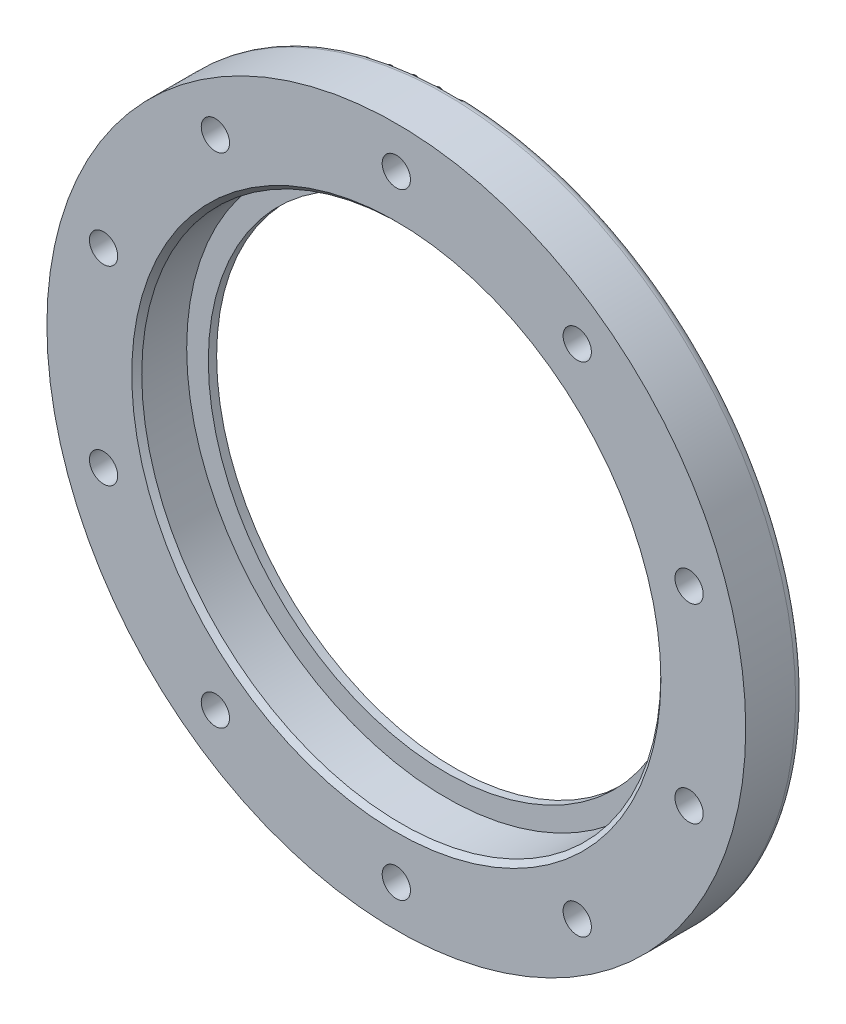
ISO-10303-21;
HEADER;
FILE_DESCRIPTION(('STEP AP214'),'2;1');
FILE_NAME('part.step','',(''),(''),'','','');
FILE_SCHEMA(('AUTOMOTIVE_DESIGN { 1 0 10303 214 1 1 1 1 }'));
ENDSEC;
DATA;
#1=APPLICATION_CONTEXT('core data for automotive mechanical design processes');
#2=APPLICATION_PROTOCOL_DEFINITION('international standard','automotive_design',2000,#1);
#3=PRODUCT_CONTEXT('',#1,'mechanical');
#4=PRODUCT('Part','Part','',(#3));
#5=PRODUCT_RELATED_PRODUCT_CATEGORY('part','',(#4));
#6=PRODUCT_DEFINITION_FORMATION('','',#4);
#7=PRODUCT_DEFINITION_CONTEXT('part definition',#1,'design');
#8=PRODUCT_DEFINITION('design','',#6,#7);
#9=PRODUCT_DEFINITION_SHAPE('','',#8);
#10=(LENGTH_UNIT() NAMED_UNIT(*) SI_UNIT(.MILLI.,.METRE.));
#11=(NAMED_UNIT(*) PLANE_ANGLE_UNIT() SI_UNIT($,.RADIAN.));
#12=(NAMED_UNIT(*) SI_UNIT($,.STERADIAN.) SOLID_ANGLE_UNIT());
#13=UNCERTAINTY_MEASURE_WITH_UNIT(LENGTH_MEASURE(1.E-05),#10,'distance_accuracy_value','');
#14=(GEOMETRIC_REPRESENTATION_CONTEXT(3) GLOBAL_UNCERTAINTY_ASSIGNED_CONTEXT((#13)) GLOBAL_UNIT_ASSIGNED_CONTEXT((#10,
#11,#12)) REPRESENTATION_CONTEXT('',''));
#15=CARTESIAN_POINT('',(0.,0.,0.));
#16=DIRECTION('',(0.,0.,1.));
#17=DIRECTION('',(1.,0.,0.));
#18=AXIS2_PLACEMENT_3D('',#15,#16,#17);
#19=CARTESIAN_POINT('',(21.7480543348212,29.9336287918721,6.));
#20=DIRECTION('',(0.,0.,-1.));
#21=DIRECTION('',(-1.,0.,0.));
#22=AXIS2_PLACEMENT_3D('',#19,#20,#21);
#23=CYLINDRICAL_SURFACE('',#22,1.70000000000102);
#24=CARTESIAN_POINT('',(21.7480543348212,29.9336287918721,6.));
#25=DIRECTION('',(0.,0.,-1.));
#26=DIRECTION('',(-1.,0.,0.));
#27=AXIS2_PLACEMENT_3D('',#24,#25,#26);
#28=CIRCLE('',#27,1.70000000000102);
#29=CARTESIAN_POINT('',(20.0480543348202,29.9336287918721,6.));
#30=VERTEX_POINT('',#29);
#31=EDGE_CURVE('E83',#30,#30,#28,.T.);
#32=ORIENTED_EDGE('',*,*,#31,.F.);
#33=EDGE_LOOP('',(#32));
#34=FACE_BOUND('',#33,.T.);
#35=CARTESIAN_POINT('',(21.7480543348212,29.9336287918721,2.2));
#36=DIRECTION('',(0.,0.,-1.));
#37=DIRECTION('',(-1.,0.,0.));
#38=AXIS2_PLACEMENT_3D('',#35,#36,#37);
#39=CIRCLE('',#38,1.70000000000102);
#40=CARTESIAN_POINT('',(20.0480543348202,29.9336287918721,2.2));
#41=VERTEX_POINT('',#40);
#42=EDGE_CURVE('E51',#41,#41,#39,.F.);
#43=ORIENTED_EDGE('',*,*,#42,.F.);
#44=EDGE_LOOP('',(#43));
#45=FACE_BOUND('',#44,.T.);
#46=ADVANCED_FACE('F30',(#34,#45),#23,.F.);
#47=CARTESIAN_POINT('',(35.1890911029196,11.4336287918716,6.));
#48=DIRECTION('',(0.,0.,-1.));
#49=DIRECTION('',(-1.,0.,0.));
#50=AXIS2_PLACEMENT_3D('',#47,#48,#49);
#51=CYLINDRICAL_SURFACE('',#50,1.70000000000188);
#52=CARTESIAN_POINT('',(35.1890911029196,11.4336287918716,6.));
#53=DIRECTION('',(0.,0.,-1.));
#54=DIRECTION('',(-1.,0.,0.));
#55=AXIS2_PLACEMENT_3D('',#52,#53,#54);
#56=CIRCLE('',#55,1.70000000000188);
#57=CARTESIAN_POINT('',(33.4890911029177,11.4336287918716,6.));
#58=VERTEX_POINT('',#57);
#59=EDGE_CURVE('E102',#58,#58,#56,.T.);
#60=ORIENTED_EDGE('',*,*,#59,.F.);
#61=EDGE_LOOP('',(#60));
#62=FACE_BOUND('',#61,.T.);
#63=CARTESIAN_POINT('',(35.1890911029196,11.4336287918716,2.2));
#64=DIRECTION('',(0.,0.,-1.));
#65=DIRECTION('',(-1.,0.,0.));
#66=AXIS2_PLACEMENT_3D('',#63,#64,#65);
#67=CIRCLE('',#66,1.70000000000188);
#68=CARTESIAN_POINT('',(33.4890911029177,11.4336287918716,2.2));
#69=VERTEX_POINT('',#68);
#70=EDGE_CURVE('E55',#69,#69,#67,.F.);
#71=ORIENTED_EDGE('',*,*,#70,.F.);
#72=EDGE_LOOP('',(#71));
#73=FACE_BOUND('',#72,.T.);
#74=ADVANCED_FACE('F242',(#62,#73),#51,.F.);
#75=CARTESIAN_POINT('',(35.1890911029186,-11.4336287918746,6.));
#76=DIRECTION('',(0.,0.,-1.));
#77=DIRECTION('',(-1.,0.,0.));
#78=AXIS2_PLACEMENT_3D('',#75,#76,#77);
#79=CYLINDRICAL_SURFACE('',#78,1.70000000000275);
#80=CARTESIAN_POINT('',(35.1890911029186,-11.4336287918746,6.));
#81=DIRECTION('',(0.,0.,-1.));
#82=DIRECTION('',(-1.,0.,0.));
#83=AXIS2_PLACEMENT_3D('',#80,#81,#82);
#84=CIRCLE('',#83,1.70000000000275);
#85=CARTESIAN_POINT('',(33.4890911029159,-11.4336287918746,6.));
#86=VERTEX_POINT('',#85);
#87=EDGE_CURVE('E105',#86,#86,#84,.T.);
#88=ORIENTED_EDGE('',*,*,#87,.F.);
#89=EDGE_LOOP('',(#88));
#90=FACE_BOUND('',#89,.T.);
#91=CARTESIAN_POINT('',(35.1890911029186,-11.4336287918746,2.2));
#92=DIRECTION('',(0.,0.,-1.));
#93=DIRECTION('',(-1.,0.,0.));
#94=AXIS2_PLACEMENT_3D('',#91,#92,#93);
#95=CIRCLE('',#94,1.70000000000275);
#96=CARTESIAN_POINT('',(33.4890911029159,-11.4336287918746,2.2));
#97=VERTEX_POINT('',#96);
#98=EDGE_CURVE('E58',#97,#97,#95,.F.);
#99=ORIENTED_EDGE('',*,*,#98,.F.);
#100=EDGE_LOOP('',(#99));
#101=FACE_BOUND('',#100,.T.);
#102=ADVANCED_FACE('F248',(#90,#101),#79,.F.);
#103=CARTESIAN_POINT('',(21.7480543348187,-29.933628791874,6.));
#104=DIRECTION('',(0.,0.,-1.));
#105=DIRECTION('',(-1.,0.,0.));
#106=AXIS2_PLACEMENT_3D('',#103,#104,#105);
#107=CYLINDRICAL_SURFACE('',#106,1.7000000000033);
#108=CARTESIAN_POINT('',(21.7480543348187,-29.933628791874,6.));
#109=DIRECTION('',(0.,0.,-1.));
#110=DIRECTION('',(-1.,0.,0.));
#111=AXIS2_PLACEMENT_3D('',#108,#109,#110);
#112=CIRCLE('',#111,1.7000000000033);
#113=CARTESIAN_POINT('',(20.0480543348154,-29.933628791874,6.));
#114=VERTEX_POINT('',#113);
#115=EDGE_CURVE('E108',#114,#114,#112,.T.);
#116=ORIENTED_EDGE('',*,*,#115,.F.);
#117=EDGE_LOOP('',(#116));
#118=FACE_BOUND('',#117,.T.);
#119=CARTESIAN_POINT('',(21.7480543348187,-29.933628791874,2.2));
#120=DIRECTION('',(0.,0.,-1.));
#121=DIRECTION('',(-1.,0.,0.));
#122=AXIS2_PLACEMENT_3D('',#119,#120,#121);
#123=CIRCLE('',#122,1.7000000000033);
#124=CARTESIAN_POINT('',(20.0480543348154,-29.933628791874,2.2));
#125=VERTEX_POINT('',#124);
#126=EDGE_CURVE('E61',#125,#125,#123,.F.);
#127=ORIENTED_EDGE('',*,*,#126,.F.);
#128=EDGE_LOOP('',(#127));
#129=FACE_BOUND('',#128,.T.);
#130=ADVANCED_FACE('F298',(#118,#129),#107,.F.);
#131=CARTESIAN_POINT('',(-3.14574736046115E-12,-37.,6.));
#132=DIRECTION('',(0.,0.,-1.));
#133=DIRECTION('',(-1.,0.,0.));
#134=AXIS2_PLACEMENT_3D('',#131,#132,#133);
#135=CYLINDRICAL_SURFACE('',#134,1.70000000000325);
#136=CARTESIAN_POINT('',(-3.14574736046115E-12,-37.,6.));
#137=DIRECTION('',(0.,0.,-1.));
#138=DIRECTION('',(-1.,0.,0.));
#139=AXIS2_PLACEMENT_3D('',#136,#137,#138);
#140=CIRCLE('',#139,1.70000000000325);
#141=CARTESIAN_POINT('',(-1.7000000000064,-37.,6.));
#142=VERTEX_POINT('',#141);
#143=EDGE_CURVE('E111',#142,#142,#140,.T.);
#144=ORIENTED_EDGE('',*,*,#143,.F.);
#145=EDGE_LOOP('',(#144));
#146=FACE_BOUND('',#145,.T.);
#147=CARTESIAN_POINT('',(-3.14574736046115E-12,-37.,2.2));
#148=DIRECTION('',(0.,0.,-1.));
#149=DIRECTION('',(-1.,0.,0.));
#150=AXIS2_PLACEMENT_3D('',#147,#148,#149);
#151=CIRCLE('',#150,1.70000000000325);
#152=CARTESIAN_POINT('',(-1.7000000000064,-37.,2.2));
#153=VERTEX_POINT('',#152);
#154=EDGE_CURVE('E64',#153,#153,#151,.F.);
#155=ORIENTED_EDGE('',*,*,#154,.F.);
#156=EDGE_LOOP('',(#155));
#157=FACE_BOUND('',#156,.T.);
#158=ADVANCED_FACE('F294',(#146,#157),#135,.F.);
#159=CARTESIAN_POINT('',(-21.7480543348244,-29.9336287918721,6.));
#160=DIRECTION('',(0.,0.,-1.));
#161=DIRECTION('',(-1.,0.,0.));
#162=AXIS2_PLACEMENT_3D('',#159,#160,#161);
#163=CYLINDRICAL_SURFACE('',#162,1.70000000000265);
#164=CARTESIAN_POINT('',(-21.7480543348244,-29.9336287918721,6.));
#165=DIRECTION('',(0.,0.,-1.));
#166=DIRECTION('',(-1.,0.,0.));
#167=AXIS2_PLACEMENT_3D('',#164,#165,#166);
#168=CIRCLE('',#167,1.70000000000265);
#169=CARTESIAN_POINT('',(-23.448054334827,-29.9336287918721,6.));
#170=VERTEX_POINT('',#169);
#171=EDGE_CURVE('E114',#170,#170,#168,.T.);
#172=ORIENTED_EDGE('',*,*,#171,.F.);
#173=EDGE_LOOP('',(#172));
#174=FACE_BOUND('',#173,.T.);
#175=CARTESIAN_POINT('',(-21.7480543348244,-29.9336287918721,2.2));
#176=DIRECTION('',(0.,0.,-1.));
#177=DIRECTION('',(-1.,0.,0.));
#178=AXIS2_PLACEMENT_3D('',#175,#176,#177);
#179=CIRCLE('',#178,1.70000000000265);
#180=CARTESIAN_POINT('',(-23.448054334827,-29.9336287918721,2.2));
#181=VERTEX_POINT('',#180);
#182=EDGE_CURVE('E67',#181,#181,#179,.F.);
#183=ORIENTED_EDGE('',*,*,#182,.F.);
#184=EDGE_LOOP('',(#183));
#185=FACE_BOUND('',#184,.T.);
#186=ADVANCED_FACE('F290',(#174,#185),#163,.F.);
#187=CARTESIAN_POINT('',(-35.1890911029227,-11.4336287918716,6.));
#188=DIRECTION('',(0.,0.,-1.));
#189=DIRECTION('',(-1.,0.,0.));
#190=AXIS2_PLACEMENT_3D('',#187,#188,#189);
#191=CYLINDRICAL_SURFACE('',#190,1.70000000000169);
#192=CARTESIAN_POINT('',(-35.1890911029227,-11.4336287918716,6.));
#193=DIRECTION('',(0.,0.,-1.));
#194=DIRECTION('',(-1.,0.,0.));
#195=AXIS2_PLACEMENT_3D('',#192,#193,#194);
#196=CIRCLE('',#195,1.70000000000169);
#197=CARTESIAN_POINT('',(-36.8890911029244,-11.4336287918716,6.));
#198=VERTEX_POINT('',#197);
#199=EDGE_CURVE('E117',#198,#198,#196,.T.);
#200=ORIENTED_EDGE('',*,*,#199,.F.);
#201=EDGE_LOOP('',(#200));
#202=FACE_BOUND('',#201,.T.);
#203=CARTESIAN_POINT('',(-35.1890911029227,-11.4336287918716,2.2));
#204=DIRECTION('',(0.,0.,-1.));
#205=DIRECTION('',(-1.,0.,0.));
#206=AXIS2_PLACEMENT_3D('',#203,#204,#205);
#207=CIRCLE('',#206,1.70000000000169);
#208=CARTESIAN_POINT('',(-36.8890911029244,-11.4336287918716,2.2));
#209=VERTEX_POINT('',#208);
#210=EDGE_CURVE('E70',#209,#209,#207,.F.);
#211=ORIENTED_EDGE('',*,*,#210,.F.);
#212=EDGE_LOOP('',(#211));
#213=FACE_BOUND('',#212,.T.);
#214=ADVANCED_FACE('F286',(#202,#213),#191,.F.);
#215=CARTESIAN_POINT('',(-35.1890911029218,11.4336287918746,6.));
#216=DIRECTION('',(0.,0.,-1.));
#217=DIRECTION('',(-1.,0.,0.));
#218=AXIS2_PLACEMENT_3D('',#215,#216,#217);
#219=CYLINDRICAL_SURFACE('',#218,1.70000000000071);
#220=CARTESIAN_POINT('',(-35.1890911029218,11.4336287918746,6.));
#221=DIRECTION('',(0.,0.,-1.));
#222=DIRECTION('',(-1.,0.,0.));
#223=AXIS2_PLACEMENT_3D('',#220,#221,#222);
#224=CIRCLE('',#223,1.70000000000071);
#225=CARTESIAN_POINT('',(-36.8890911029225,11.4336287918746,6.));
#226=VERTEX_POINT('',#225);
#227=EDGE_CURVE('E120',#226,#226,#224,.T.);
#228=ORIENTED_EDGE('',*,*,#227,.F.);
#229=EDGE_LOOP('',(#228));
#230=FACE_BOUND('',#229,.T.);
#231=CARTESIAN_POINT('',(-35.1890911029218,11.4336287918746,2.2));
#232=DIRECTION('',(0.,0.,-1.));
#233=DIRECTION('',(-1.,0.,0.));
#234=AXIS2_PLACEMENT_3D('',#231,#232,#233);
#235=CIRCLE('',#234,1.70000000000071);
#236=CARTESIAN_POINT('',(-36.8890911029225,11.4336287918746,2.2));
#237=VERTEX_POINT('',#236);
#238=EDGE_CURVE('E73',#237,#237,#235,.F.);
#239=ORIENTED_EDGE('',*,*,#238,.F.);
#240=EDGE_LOOP('',(#239));
#241=FACE_BOUND('',#240,.T.);
#242=ADVANCED_FACE('F264',(#230,#241),#219,.F.);
#243=CARTESIAN_POINT('',(-21.7480543348218,29.933628791874,6.));
#244=DIRECTION('',(0.,0.,-1.));
#245=DIRECTION('',(-1.,0.,0.));
#246=AXIS2_PLACEMENT_3D('',#243,#244,#245);
#247=CYLINDRICAL_SURFACE('',#246,1.70000000000007);
#248=CARTESIAN_POINT('',(-21.7480543348218,29.933628791874,6.));
#249=DIRECTION('',(0.,0.,-1.));
#250=DIRECTION('',(-1.,0.,0.));
#251=AXIS2_PLACEMENT_3D('',#248,#249,#250);
#252=CIRCLE('',#251,1.70000000000007);
#253=CARTESIAN_POINT('',(-23.4480543348219,29.933628791874,6.));
#254=VERTEX_POINT('',#253);
#255=EDGE_CURVE('E99',#254,#254,#252,.T.);
#256=ORIENTED_EDGE('',*,*,#255,.F.);
#257=EDGE_LOOP('',(#256));
#258=FACE_BOUND('',#257,.T.);
#259=CARTESIAN_POINT('',(-21.7480543348218,29.933628791874,2.2));
#260=DIRECTION('',(0.,0.,-1.));
#261=DIRECTION('',(-1.,0.,0.));
#262=AXIS2_PLACEMENT_3D('',#259,#260,#261);
#263=CIRCLE('',#262,1.70000000000007);
#264=CARTESIAN_POINT('',(-23.4480543348219,29.933628791874,2.2));
#265=VERTEX_POINT('',#264);
#266=EDGE_CURVE('E76',#265,#265,#263,.F.);
#267=ORIENTED_EDGE('',*,*,#266,.F.);
#268=EDGE_LOOP('',(#267));
#269=FACE_BOUND('',#268,.T.);
#270=ADVANCED_FACE('F257',(#258,#269),#247,.F.);
#271=CARTESIAN_POINT('',(0.,37.,6.));
#272=DIRECTION('',(0.,0.,-1.));
#273=DIRECTION('',(-1.,0.,0.));
#274=AXIS2_PLACEMENT_3D('',#271,#272,#273);
#275=CYLINDRICAL_SURFACE('',#274,1.7);
#276=CARTESIAN_POINT('',(0.,37.,6.));
#277=DIRECTION('',(0.,0.,-1.));
#278=DIRECTION('',(-1.,0.,0.));
#279=AXIS2_PLACEMENT_3D('',#276,#277,#278);
#280=CIRCLE('',#279,1.7);
#281=CARTESIAN_POINT('',(-1.7,37.,6.));
#282=VERTEX_POINT('',#281);
#283=EDGE_CURVE('E94',#282,#282,#280,.T.);
#284=ORIENTED_EDGE('',*,*,#283,.F.);
#285=EDGE_LOOP('',(#284));
#286=FACE_BOUND('',#285,.T.);
#287=CARTESIAN_POINT('',(0.,37.,2.2));
#288=DIRECTION('',(0.,0.,-1.));
#289=DIRECTION('',(-1.,0.,0.));
#290=AXIS2_PLACEMENT_3D('',#287,#288,#289);
#291=CIRCLE('',#290,1.7);
#292=CARTESIAN_POINT('',(-1.7,37.,2.2));
#293=VERTEX_POINT('',#292);
#294=EDGE_CURVE('E80',#293,#293,#291,.F.);
#295=ORIENTED_EDGE('',*,*,#294,.F.);
#296=EDGE_LOOP('',(#295));
#297=FACE_BOUND('',#296,.T.);
#298=ADVANCED_FACE('F255',(#286,#297),#275,.F.);
#299=CARTESIAN_POINT('',(0.,0.,6.));
#300=DIRECTION('',(0.,0.,1.));
#301=DIRECTION('',(1.,0.,0.));
#302=AXIS2_PLACEMENT_3D('',#299,#300,#301);
#303=PLANE('',#302);
#304=CARTESIAN_POINT('',(0.,0.,6.));
#305=DIRECTION('',(0.,0.,1.));
#306=DIRECTION('',(1.,0.,0.));
#307=AXIS2_PLACEMENT_3D('',#304,#305,#306);
#308=CIRCLE('',#307,31.8);
#309=CARTESIAN_POINT('',(31.8,0.,6.));
#310=VERTEX_POINT('',#309);
#311=EDGE_CURVE('E41',#310,#310,#308,.F.);
#312=ORIENTED_EDGE('',*,*,#311,.T.);
#313=EDGE_LOOP('',(#312));
#314=FACE_BOUND('',#313,.T.);
#315=ORIENTED_EDGE('',*,*,#255,.T.);
#316=EDGE_LOOP('',(#315));
#317=FACE_BOUND('',#316,.T.);
#318=ORIENTED_EDGE('',*,*,#227,.T.);
#319=EDGE_LOOP('',(#318));
#320=FACE_BOUND('',#319,.T.);
#321=ORIENTED_EDGE('',*,*,#199,.T.);
#322=EDGE_LOOP('',(#321));
#323=FACE_BOUND('',#322,.T.);
#324=ORIENTED_EDGE('',*,*,#171,.T.);
#325=EDGE_LOOP('',(#324));
#326=FACE_BOUND('',#325,.T.);
#327=ORIENTED_EDGE('',*,*,#143,.T.);
#328=EDGE_LOOP('',(#327));
#329=FACE_BOUND('',#328,.T.);
#330=ORIENTED_EDGE('',*,*,#115,.T.);
#331=EDGE_LOOP('',(#330));
#332=FACE_BOUND('',#331,.T.);
#333=ORIENTED_EDGE('',*,*,#87,.T.);
#334=EDGE_LOOP('',(#333));
#335=FACE_BOUND('',#334,.T.);
#336=ORIENTED_EDGE('',*,*,#59,.T.);
#337=EDGE_LOOP('',(#336));
#338=FACE_BOUND('',#337,.T.);
#339=ORIENTED_EDGE('',*,*,#31,.T.);
#340=EDGE_LOOP('',(#339));
#341=FACE_BOUND('',#340,.T.);
#342=ORIENTED_EDGE('',*,*,#283,.T.);
#343=EDGE_LOOP('',(#342));
#344=FACE_BOUND('',#343,.T.);
#345=CARTESIAN_POINT('',(0.,0.,6.));
#346=DIRECTION('',(0.,0.,1.));
#347=DIRECTION('',(1.,0.,0.));
#348=AXIS2_PLACEMENT_3D('',#345,#346,#347);
#349=CIRCLE('',#348,42.);
#350=CARTESIAN_POINT('',(42.,0.,6.));
#351=VERTEX_POINT('',#350);
#352=EDGE_CURVE('E50',#351,#351,#349,.T.);
#353=ORIENTED_EDGE('',*,*,#352,.T.);
#354=EDGE_LOOP('',(#353));
#355=FACE_BOUND('',#354,.T.);
#356=ADVANCED_FACE('F238',(#314,#317,#320,#323,#326,#329,#332,#335,#338,#341,#344,#355),#303,.T.);
#357=CARTESIAN_POINT('',(0.,0.,6.));
#358=DIRECTION('',(0.,0.,-1.));
#359=DIRECTION('',(-1.,0.,0.));
#360=AXIS2_PLACEMENT_3D('',#357,#358,#359);
#361=CYLINDRICAL_SURFACE('',#360,42.);
#362=CARTESIAN_POINT('',(0.,0.,0.));
#363=DIRECTION('',(0.,0.,-1.));
#364=DIRECTION('',(-1.,0.,0.));
#365=AXIS2_PLACEMENT_3D('',#362,#363,#364);
#366=CIRCLE('',#365,42.);
#367=CARTESIAN_POINT('',(-42.,0.,0.));
#368=VERTEX_POINT('',#367);
#369=EDGE_CURVE('E10',#368,#368,#366,.F.);
#370=ORIENTED_EDGE('',*,*,#369,.T.);
#371=EDGE_LOOP('',(#370));
#372=FACE_BOUND('',#371,.T.);
#373=ORIENTED_EDGE('',*,*,#352,.F.);
#374=EDGE_LOOP('',(#373));
#375=FACE_BOUND('',#374,.T.);
#376=ADVANCED_FACE('F232',(#372,#375),#361,.T.);
#377=CARTESIAN_POINT('',(0.,0.,6.));
#378=DIRECTION('',(0.,0.,-1.));
#379=DIRECTION('',(-1.,0.,0.));
#380=AXIS2_PLACEMENT_3D('',#377,#378,#379);
#381=CYLINDRICAL_SURFACE('',#380,31.2);
#382=CARTESIAN_POINT('',(0.,0.,5.40000000000003));
#383=DIRECTION('',(0.,0.,1.));
#384=DIRECTION('',(1.,0.,0.));
#385=AXIS2_PLACEMENT_3D('',#382,#383,#384);
#386=CIRCLE('',#385,31.2);
#387=CARTESIAN_POINT('',(31.2,0.,5.40000000000003));
#388=VERTEX_POINT('',#387);
#389=EDGE_CURVE('E45',#388,#388,#386,.T.);
#390=ORIENTED_EDGE('',*,*,#389,.T.);
#391=EDGE_LOOP('',(#390));
#392=FACE_BOUND('',#391,.T.);
#393=CARTESIAN_POINT('',(0.,0.,0.));
#394=DIRECTION('',(0.,0.,1.));
#395=DIRECTION('',(1.,0.,0.));
#396=AXIS2_PLACEMENT_3D('',#393,#394,#395);
#397=CIRCLE('',#396,31.2);
#398=CARTESIAN_POINT('',(31.2,0.,0.));
#399=VERTEX_POINT('',#398);
#400=EDGE_CURVE('E87',#399,#399,#397,.T.);
#401=ORIENTED_EDGE('',*,*,#400,.F.);
#402=EDGE_LOOP('',(#401));
#403=FACE_BOUND('',#402,.T.);
#404=ADVANCED_FACE('F227',(#392,#403),#381,.F.);
#405=CARTESIAN_POINT('',(0.,0.,0.));
#406=DIRECTION('',(0.,0.,-1.));
#407=DIRECTION('',(-1.,0.,0.));
#408=AXIS2_PLACEMENT_3D('',#405,#406,#407);
#409=PLANE('',#408);
#410=CARTESIAN_POINT('',(0.,0.,0.));
#411=DIRECTION('',(0.,0.,-1.));
#412=DIRECTION('',(-1.,0.,0.));
#413=AXIS2_PLACEMENT_3D('',#410,#411,#412);
#414=CIRCLE('',#413,28.6);
#415=CARTESIAN_POINT('',(-28.6,0.,0.));
#416=VERTEX_POINT('',#415);
#417=EDGE_CURVE('E91',#416,#416,#414,.T.);
#418=ORIENTED_EDGE('',*,*,#417,.T.);
#419=EDGE_LOOP('',(#418));
#420=FACE_BOUND('',#419,.T.);
#421=ORIENTED_EDGE('',*,*,#400,.T.);
#422=EDGE_LOOP('',(#421));
#423=FACE_BOUND('',#422,.T.);
#424=ADVANCED_FACE('F197',(#420,#423),#409,.F.);
#425=CARTESIAN_POINT('',(0.,0.,-1.));
#426=DIRECTION('',(0.,0.,-1.));
#427=DIRECTION('',(-1.,0.,0.));
#428=AXIS2_PLACEMENT_3D('',#425,#426,#427);
#429=PLANE('',#428);
#430=CARTESIAN_POINT('',(0.,0.,-1.));
#431=DIRECTION('',(0.,0.,-1.));
#432=DIRECTION('',(-1.,0.,0.));
#433=AXIS2_PLACEMENT_3D('',#430,#431,#432);
#434=CIRCLE('',#433,41.);
#435=CARTESIAN_POINT('',(-41.,0.,-1.));
#436=VERTEX_POINT('',#435);
#437=EDGE_CURVE('E37',#436,#436,#434,.T.);
#438=ORIENTED_EDGE('',*,*,#437,.T.);
#439=EDGE_LOOP('',(#438));
#440=FACE_BOUND('',#439,.T.);
#441=CARTESIAN_POINT('',(-21.7480543348218,29.933628791874,-1.));
#442=DIRECTION('',(0.,0.,-1.));
#443=DIRECTION('',(-1.,0.,0.));
#444=AXIS2_PLACEMENT_3D('',#441,#442,#443);
#445=CIRCLE('',#444,3.00000000000007);
#446=CARTESIAN_POINT('',(-24.7480543348219,29.933628791874,-1.));
#447=VERTEX_POINT('',#446);
#448=EDGE_CURVE('E177',#447,#447,#445,.T.);
#449=ORIENTED_EDGE('',*,*,#448,.F.);
#450=EDGE_LOOP('',(#449));
#451=FACE_BOUND('',#450,.T.);
#452=CARTESIAN_POINT('',(-35.1890911029218,11.4336287918746,-1.));
#453=DIRECTION('',(0.,0.,-1.));
#454=DIRECTION('',(-1.,0.,0.));
#455=AXIS2_PLACEMENT_3D('',#452,#453,#454);
#456=CIRCLE('',#455,3.00000000000071);
#457=CARTESIAN_POINT('',(-38.1890911029225,11.4336287918746,-1.));
#458=VERTEX_POINT('',#457);
#459=EDGE_CURVE('E171',#458,#458,#456,.T.);
#460=ORIENTED_EDGE('',*,*,#459,.F.);
#461=EDGE_LOOP('',(#460));
#462=FACE_BOUND('',#461,.T.);
#463=CARTESIAN_POINT('',(-35.1890911029227,-11.4336287918716,-1.));
#464=DIRECTION('',(0.,0.,-1.));
#465=DIRECTION('',(-1.,0.,0.));
#466=AXIS2_PLACEMENT_3D('',#463,#464,#465);
#467=CIRCLE('',#466,3.00000000000169);
#468=CARTESIAN_POINT('',(-38.1890911029244,-11.4336287918716,-1.));
#469=VERTEX_POINT('',#468);
#470=EDGE_CURVE('E165',#469,#469,#467,.T.);
#471=ORIENTED_EDGE('',*,*,#470,.F.);
#472=EDGE_LOOP('',(#471));
#473=FACE_BOUND('',#472,.T.);
#474=CARTESIAN_POINT('',(-21.7480543348244,-29.9336287918721,-1.));
#475=DIRECTION('',(0.,0.,-1.));
#476=DIRECTION('',(-1.,0.,0.));
#477=AXIS2_PLACEMENT_3D('',#474,#475,#476);
#478=CIRCLE('',#477,3.00000000000265);
#479=CARTESIAN_POINT('',(-24.748054334827,-29.9336287918721,-1.));
#480=VERTEX_POINT('',#479);
#481=EDGE_CURVE('E159',#480,#480,#478,.T.);
#482=ORIENTED_EDGE('',*,*,#481,.F.);
#483=EDGE_LOOP('',(#482));
#484=FACE_BOUND('',#483,.T.);
#485=CARTESIAN_POINT('',(-3.14574736046115E-12,-37.,-1.));
#486=DIRECTION('',(0.,0.,-1.));
#487=DIRECTION('',(-1.,0.,0.));
#488=AXIS2_PLACEMENT_3D('',#485,#486,#487);
#489=CIRCLE('',#488,3.00000000000326);
#490=CARTESIAN_POINT('',(-3.0000000000064,-37.,-1.));
#491=VERTEX_POINT('',#490);
#492=EDGE_CURVE('E153',#491,#491,#489,.T.);
#493=ORIENTED_EDGE('',*,*,#492,.F.);
#494=EDGE_LOOP('',(#493));
#495=FACE_BOUND('',#494,.T.);
#496=CARTESIAN_POINT('',(21.7480543348187,-29.933628791874,-1.));
#497=DIRECTION('',(0.,0.,-1.));
#498=DIRECTION('',(-1.,0.,0.));
#499=AXIS2_PLACEMENT_3D('',#496,#497,#498);
#500=CIRCLE('',#499,3.0000000000033);
#501=CARTESIAN_POINT('',(18.7480543348154,-29.933628791874,-1.));
#502=VERTEX_POINT('',#501);
#503=EDGE_CURVE('E147',#502,#502,#500,.T.);
#504=ORIENTED_EDGE('',*,*,#503,.F.);
#505=EDGE_LOOP('',(#504));
#506=FACE_BOUND('',#505,.T.);
#507=CARTESIAN_POINT('',(35.1890911029186,-11.4336287918746,-1.));
#508=DIRECTION('',(0.,0.,-1.));
#509=DIRECTION('',(-1.,0.,0.));
#510=AXIS2_PLACEMENT_3D('',#507,#508,#509);
#511=CIRCLE('',#510,3.00000000000275);
#512=CARTESIAN_POINT('',(32.1890911029159,-11.4336287918746,-1.));
#513=VERTEX_POINT('',#512);
#514=EDGE_CURVE('E141',#513,#513,#511,.T.);
#515=ORIENTED_EDGE('',*,*,#514,.F.);
#516=EDGE_LOOP('',(#515));
#517=FACE_BOUND('',#516,.T.);
#518=CARTESIAN_POINT('',(35.1890911029196,11.4336287918716,-1.));
#519=DIRECTION('',(0.,0.,-1.));
#520=DIRECTION('',(-1.,0.,0.));
#521=AXIS2_PLACEMENT_3D('',#518,#519,#520);
#522=CIRCLE('',#521,3.00000000000188);
#523=CARTESIAN_POINT('',(32.1890911029177,11.4336287918716,-1.));
#524=VERTEX_POINT('',#523);
#525=EDGE_CURVE('E135',#524,#524,#522,.T.);
#526=ORIENTED_EDGE('',*,*,#525,.F.);
#527=EDGE_LOOP('',(#526));
#528=FACE_BOUND('',#527,.T.);
#529=CARTESIAN_POINT('',(21.7480543348212,29.9336287918721,-1.));
#530=DIRECTION('',(0.,0.,-1.));
#531=DIRECTION('',(-1.,0.,0.));
#532=AXIS2_PLACEMENT_3D('',#529,#530,#531);
#533=CIRCLE('',#532,3.00000000000103);
#534=CARTESIAN_POINT('',(18.7480543348202,29.9336287918721,-1.));
#535=VERTEX_POINT('',#534);
#536=EDGE_CURVE('E129',#535,#535,#533,.T.);
#537=ORIENTED_EDGE('',*,*,#536,.F.);
#538=EDGE_LOOP('',(#537));
#539=FACE_BOUND('',#538,.T.);
#540=CARTESIAN_POINT('',(0.,37.,-1.));
#541=DIRECTION('',(0.,0.,-1.));
#542=DIRECTION('',(-1.,0.,0.));
#543=AXIS2_PLACEMENT_3D('',#540,#541,#542);
#544=CIRCLE('',#543,3.);
#545=CARTESIAN_POINT('',(-3.,37.,-1.));
#546=VERTEX_POINT('',#545);
#547=EDGE_CURVE('E54',#546,#546,#544,.T.);
#548=ORIENTED_EDGE('',*,*,#547,.F.);
#549=EDGE_LOOP('',(#548));
#550=FACE_BOUND('',#549,.T.);
#551=CARTESIAN_POINT('',(0.,0.,-1.));
#552=DIRECTION('',(0.,0.,-1.));
#553=DIRECTION('',(-1.,0.,0.));
#554=AXIS2_PLACEMENT_3D('',#551,#552,#553);
#555=CIRCLE('',#554,28.6);
#556=CARTESIAN_POINT('',(-28.6,0.,-1.));
#557=VERTEX_POINT('',#556);
#558=EDGE_CURVE('E90',#557,#557,#555,.T.);
#559=ORIENTED_EDGE('',*,*,#558,.F.);
#560=EDGE_LOOP('',(#559));
#561=FACE_BOUND('',#560,.T.);
#562=ADVANCED_FACE('F193',(#440,#451,#462,#473,#484,#495,#506,#517,#528,#539,#550,#561),#429,.T.);
#563=CARTESIAN_POINT('',(0.,0.,-1.));
#564=DIRECTION('',(0.,0.,1.));
#565=DIRECTION('',(1.,0.,0.));
#566=AXIS2_PLACEMENT_3D('',#563,#564,#565);
#567=CYLINDRICAL_SURFACE('',#566,28.6);
#568=ORIENTED_EDGE('',*,*,#558,.T.);
#569=EDGE_LOOP('',(#568));
#570=FACE_BOUND('',#569,.T.);
#571=ORIENTED_EDGE('',*,*,#417,.F.);
#572=EDGE_LOOP('',(#571));
#573=FACE_BOUND('',#572,.T.);
#574=ADVANCED_FACE('F196',(#570,#573),#567,.F.);
#575=CARTESIAN_POINT('',(0.,37.,2.2));
#576=DIRECTION('',(0.,0.,-1.));
#577=DIRECTION('',(-1.,0.,0.));
#578=AXIS2_PLACEMENT_3D('',#575,#576,#577);
#579=PLANE('',#578);
#580=CARTESIAN_POINT('',(0.,37.,2.2));
#581=DIRECTION('',(0.,0.,-1.));
#582=DIRECTION('',(-1.,0.,0.));
#583=AXIS2_PLACEMENT_3D('',#580,#581,#582);
#584=CIRCLE('',#583,3.);
#585=CARTESIAN_POINT('',(-3.,37.,2.2));
#586=VERTEX_POINT('',#585);
#587=EDGE_CURVE('E84',#586,#586,#584,.T.);
#588=ORIENTED_EDGE('',*,*,#587,.T.);
#589=EDGE_LOOP('',(#588));
#590=FACE_BOUND('',#589,.T.);
#591=ORIENTED_EDGE('',*,*,#294,.T.);
#592=EDGE_LOOP('',(#591));
#593=FACE_BOUND('',#592,.T.);
#594=ADVANCED_FACE('F221',(#590,#593),#579,.T.);
#595=CARTESIAN_POINT('',(0.,37.,2.2));
#596=DIRECTION('',(0.,0.,-1.));
#597=DIRECTION('',(-1.,0.,0.));
#598=AXIS2_PLACEMENT_3D('',#595,#596,#597);
#599=CYLINDRICAL_SURFACE('',#598,3.);
#600=ORIENTED_EDGE('',*,*,#587,.F.);
#601=EDGE_LOOP('',(#600));
#602=FACE_BOUND('',#601,.T.);
#603=ORIENTED_EDGE('',*,*,#547,.T.);
#604=EDGE_LOOP('',(#603));
#605=FACE_BOUND('',#604,.T.);
#606=ADVANCED_FACE('F272',(#602,#605),#599,.F.);
#607=CARTESIAN_POINT('',(-21.7480543348218,29.933628791874,2.2));
#608=DIRECTION('',(0.,0.,-1.));
#609=DIRECTION('',(-1.,0.,0.));
#610=AXIS2_PLACEMENT_3D('',#607,#608,#609);
#611=PLANE('',#610);
#612=CARTESIAN_POINT('',(-21.7480543348218,29.933628791874,2.2));
#613=DIRECTION('',(0.,0.,-1.));
#614=DIRECTION('',(-1.,0.,0.));
#615=AXIS2_PLACEMENT_3D('',#612,#613,#614);
#616=CIRCLE('',#615,3.00000000000007);
#617=CARTESIAN_POINT('',(-24.7480543348219,29.933628791874,2.2));
#618=VERTEX_POINT('',#617);
#619=EDGE_CURVE('E79',#618,#618,#616,.T.);
#620=ORIENTED_EDGE('',*,*,#619,.T.);
#621=EDGE_LOOP('',(#620));
#622=FACE_BOUND('',#621,.T.);
#623=ORIENTED_EDGE('',*,*,#266,.T.);
#624=EDGE_LOOP('',(#623));
#625=FACE_BOUND('',#624,.T.);
#626=ADVANCED_FACE('F183',(#622,#625),#611,.T.);
#627=CARTESIAN_POINT('',(-21.7480543348218,29.933628791874,2.2));
#628=DIRECTION('',(0.,0.,-1.));
#629=DIRECTION('',(-1.,0.,0.));
#630=AXIS2_PLACEMENT_3D('',#627,#628,#629);
#631=CYLINDRICAL_SURFACE('',#630,3.00000000000007);
#632=ORIENTED_EDGE('',*,*,#619,.F.);
#633=EDGE_LOOP('',(#632));
#634=FACE_BOUND('',#633,.T.);
#635=ORIENTED_EDGE('',*,*,#448,.T.);
#636=EDGE_LOOP('',(#635));
#637=FACE_BOUND('',#636,.T.);
#638=ADVANCED_FACE('F186',(#634,#637),#631,.F.);
#639=CARTESIAN_POINT('',(-35.1890911029218,11.4336287918746,2.2));
#640=DIRECTION('',(0.,0.,-1.));
#641=DIRECTION('',(-1.,0.,0.));
#642=AXIS2_PLACEMENT_3D('',#639,#640,#641);
#643=PLANE('',#642);
#644=CARTESIAN_POINT('',(-35.1890911029218,11.4336287918746,2.2));
#645=DIRECTION('',(0.,0.,-1.));
#646=DIRECTION('',(-1.,0.,0.));
#647=AXIS2_PLACEMENT_3D('',#644,#645,#646);
#648=CIRCLE('',#647,3.00000000000071);
#649=CARTESIAN_POINT('',(-38.1890911029225,11.4336287918746,2.2));
#650=VERTEX_POINT('',#649);
#651=EDGE_CURVE('E174',#650,#650,#648,.T.);
#652=ORIENTED_EDGE('',*,*,#651,.T.);
#653=EDGE_LOOP('',(#652));
#654=FACE_BOUND('',#653,.T.);
#655=ORIENTED_EDGE('',*,*,#238,.T.);
#656=EDGE_LOOP('',(#655));
#657=FACE_BOUND('',#656,.T.);
#658=ADVANCED_FACE('F189',(#654,#657),#643,.T.);
#659=CARTESIAN_POINT('',(-35.1890911029218,11.4336287918746,2.2));
#660=DIRECTION('',(0.,0.,-1.));
#661=DIRECTION('',(-1.,0.,0.));
#662=AXIS2_PLACEMENT_3D('',#659,#660,#661);
#663=CYLINDRICAL_SURFACE('',#662,3.00000000000071);
#664=ORIENTED_EDGE('',*,*,#651,.F.);
#665=EDGE_LOOP('',(#664));
#666=FACE_BOUND('',#665,.T.);
#667=ORIENTED_EDGE('',*,*,#459,.T.);
#668=EDGE_LOOP('',(#667));
#669=FACE_BOUND('',#668,.T.);
#670=ADVANCED_FACE('F411',(#666,#669),#663,.F.);
#671=CARTESIAN_POINT('',(-35.1890911029227,-11.4336287918716,2.2));
#672=DIRECTION('',(0.,0.,-1.));
#673=DIRECTION('',(-1.,0.,0.));
#674=AXIS2_PLACEMENT_3D('',#671,#672,#673);
#675=PLANE('',#674);
#676=CARTESIAN_POINT('',(-35.1890911029227,-11.4336287918716,2.2));
#677=DIRECTION('',(0.,0.,-1.));
#678=DIRECTION('',(-1.,0.,0.));
#679=AXIS2_PLACEMENT_3D('',#676,#677,#678);
#680=CIRCLE('',#679,3.00000000000169);
#681=CARTESIAN_POINT('',(-38.1890911029244,-11.4336287918716,2.2));
#682=VERTEX_POINT('',#681);
#683=EDGE_CURVE('E168',#682,#682,#680,.T.);
#684=ORIENTED_EDGE('',*,*,#683,.T.);
#685=EDGE_LOOP('',(#684));
#686=FACE_BOUND('',#685,.T.);
#687=ORIENTED_EDGE('',*,*,#210,.T.);
#688=EDGE_LOOP('',(#687));
#689=FACE_BOUND('',#688,.T.);
#690=ADVANCED_FACE('F407',(#686,#689),#675,.T.);
#691=CARTESIAN_POINT('',(-35.1890911029227,-11.4336287918716,2.2));
#692=DIRECTION('',(0.,0.,-1.));
#693=DIRECTION('',(-1.,0.,0.));
#694=AXIS2_PLACEMENT_3D('',#691,#692,#693);
#695=CYLINDRICAL_SURFACE('',#694,3.00000000000169);
#696=ORIENTED_EDGE('',*,*,#683,.F.);
#697=EDGE_LOOP('',(#696));
#698=FACE_BOUND('',#697,.T.);
#699=ORIENTED_EDGE('',*,*,#470,.T.);
#700=EDGE_LOOP('',(#699));
#701=FACE_BOUND('',#700,.T.);
#702=ADVANCED_FACE('F403',(#698,#701),#695,.F.);
#703=CARTESIAN_POINT('',(-21.7480543348244,-29.9336287918721,2.2));
#704=DIRECTION('',(0.,0.,-1.));
#705=DIRECTION('',(-1.,0.,0.));
#706=AXIS2_PLACEMENT_3D('',#703,#704,#705);
#707=PLANE('',#706);
#708=CARTESIAN_POINT('',(-21.7480543348244,-29.9336287918721,2.2));
#709=DIRECTION('',(0.,0.,-1.));
#710=DIRECTION('',(-1.,0.,0.));
#711=AXIS2_PLACEMENT_3D('',#708,#709,#710);
#712=CIRCLE('',#711,3.00000000000265);
#713=CARTESIAN_POINT('',(-24.748054334827,-29.9336287918721,2.2));
#714=VERTEX_POINT('',#713);
#715=EDGE_CURVE('E162',#714,#714,#712,.T.);
#716=ORIENTED_EDGE('',*,*,#715,.T.);
#717=EDGE_LOOP('',(#716));
#718=FACE_BOUND('',#717,.T.);
#719=ORIENTED_EDGE('',*,*,#182,.T.);
#720=EDGE_LOOP('',(#719));
#721=FACE_BOUND('',#720,.T.);
#722=ADVANCED_FACE('F399',(#718,#721),#707,.T.);
#723=CARTESIAN_POINT('',(-21.7480543348244,-29.9336287918721,2.2));
#724=DIRECTION('',(0.,0.,-1.));
#725=DIRECTION('',(-1.,0.,0.));
#726=AXIS2_PLACEMENT_3D('',#723,#724,#725);
#727=CYLINDRICAL_SURFACE('',#726,3.00000000000265);
#728=ORIENTED_EDGE('',*,*,#715,.F.);
#729=EDGE_LOOP('',(#728));
#730=FACE_BOUND('',#729,.T.);
#731=ORIENTED_EDGE('',*,*,#481,.T.);
#732=EDGE_LOOP('',(#731));
#733=FACE_BOUND('',#732,.T.);
#734=ADVANCED_FACE('F395',(#730,#733),#727,.F.);
#735=CARTESIAN_POINT('',(-3.14574736046115E-12,-37.,2.2));
#736=DIRECTION('',(0.,0.,-1.));
#737=DIRECTION('',(-1.,0.,0.));
#738=AXIS2_PLACEMENT_3D('',#735,#736,#737);
#739=PLANE('',#738);
#740=CARTESIAN_POINT('',(-3.14574736046115E-12,-37.,2.2));
#741=DIRECTION('',(0.,0.,-1.));
#742=DIRECTION('',(-1.,0.,0.));
#743=AXIS2_PLACEMENT_3D('',#740,#741,#742);
#744=CIRCLE('',#743,3.00000000000326);
#745=CARTESIAN_POINT('',(-3.0000000000064,-37.,2.2));
#746=VERTEX_POINT('',#745);
#747=EDGE_CURVE('E156',#746,#746,#744,.T.);
#748=ORIENTED_EDGE('',*,*,#747,.T.);
#749=EDGE_LOOP('',(#748));
#750=FACE_BOUND('',#749,.T.);
#751=ORIENTED_EDGE('',*,*,#154,.T.);
#752=EDGE_LOOP('',(#751));
#753=FACE_BOUND('',#752,.T.);
#754=ADVANCED_FACE('F389',(#750,#753),#739,.T.);
#755=CARTESIAN_POINT('',(-3.14574736046115E-12,-37.,2.2));
#756=DIRECTION('',(0.,0.,-1.));
#757=DIRECTION('',(-1.,0.,0.));
#758=AXIS2_PLACEMENT_3D('',#755,#756,#757);
#759=CYLINDRICAL_SURFACE('',#758,3.00000000000326);
#760=ORIENTED_EDGE('',*,*,#747,.F.);
#761=EDGE_LOOP('',(#760));
#762=FACE_BOUND('',#761,.T.);
#763=ORIENTED_EDGE('',*,*,#492,.T.);
#764=EDGE_LOOP('',(#763));
#765=FACE_BOUND('',#764,.T.);
#766=ADVANCED_FACE('F384',(#762,#765),#759,.F.);
#767=CARTESIAN_POINT('',(21.7480543348187,-29.933628791874,2.2));
#768=DIRECTION('',(0.,0.,-1.));
#769=DIRECTION('',(-1.,0.,0.));
#770=AXIS2_PLACEMENT_3D('',#767,#768,#769);
#771=PLANE('',#770);
#772=CARTESIAN_POINT('',(21.7480543348187,-29.933628791874,2.2));
#773=DIRECTION('',(0.,0.,-1.));
#774=DIRECTION('',(-1.,0.,0.));
#775=AXIS2_PLACEMENT_3D('',#772,#773,#774);
#776=CIRCLE('',#775,3.0000000000033);
#777=CARTESIAN_POINT('',(18.7480543348154,-29.933628791874,2.2));
#778=VERTEX_POINT('',#777);
#779=EDGE_CURVE('E150',#778,#778,#776,.T.);
#780=ORIENTED_EDGE('',*,*,#779,.T.);
#781=EDGE_LOOP('',(#780));
#782=FACE_BOUND('',#781,.T.);
#783=ORIENTED_EDGE('',*,*,#126,.T.);
#784=EDGE_LOOP('',(#783));
#785=FACE_BOUND('',#784,.T.);
#786=ADVANCED_FACE('F323',(#782,#785),#771,.T.);
#787=CARTESIAN_POINT('',(21.7480543348187,-29.933628791874,2.2));
#788=DIRECTION('',(0.,0.,-1.));
#789=DIRECTION('',(-1.,0.,0.));
#790=AXIS2_PLACEMENT_3D('',#787,#788,#789);
#791=CYLINDRICAL_SURFACE('',#790,3.0000000000033);
#792=ORIENTED_EDGE('',*,*,#779,.F.);
#793=EDGE_LOOP('',(#792));
#794=FACE_BOUND('',#793,.T.);
#795=ORIENTED_EDGE('',*,*,#503,.T.);
#796=EDGE_LOOP('',(#795));
#797=FACE_BOUND('',#796,.T.);
#798=ADVANCED_FACE('F313',(#794,#797),#791,.F.);
#799=CARTESIAN_POINT('',(35.1890911029186,-11.4336287918746,2.2));
#800=DIRECTION('',(0.,0.,-1.));
#801=DIRECTION('',(-1.,0.,0.));
#802=AXIS2_PLACEMENT_3D('',#799,#800,#801);
#803=PLANE('',#802);
#804=CARTESIAN_POINT('',(35.1890911029186,-11.4336287918746,2.2));
#805=DIRECTION('',(0.,0.,-1.));
#806=DIRECTION('',(-1.,0.,0.));
#807=AXIS2_PLACEMENT_3D('',#804,#805,#806);
#808=CIRCLE('',#807,3.00000000000275);
#809=CARTESIAN_POINT('',(32.1890911029159,-11.4336287918746,2.2));
#810=VERTEX_POINT('',#809);
#811=EDGE_CURVE('E144',#810,#810,#808,.T.);
#812=ORIENTED_EDGE('',*,*,#811,.T.);
#813=EDGE_LOOP('',(#812));
#814=FACE_BOUND('',#813,.T.);
#815=ORIENTED_EDGE('',*,*,#98,.T.);
#816=EDGE_LOOP('',(#815));
#817=FACE_BOUND('',#816,.T.);
#818=ADVANCED_FACE('F310',(#814,#817),#803,.T.);
#819=CARTESIAN_POINT('',(35.1890911029186,-11.4336287918746,2.2));
#820=DIRECTION('',(0.,0.,-1.));
#821=DIRECTION('',(-1.,0.,0.));
#822=AXIS2_PLACEMENT_3D('',#819,#820,#821);
#823=CYLINDRICAL_SURFACE('',#822,3.00000000000275);
#824=ORIENTED_EDGE('',*,*,#811,.F.);
#825=EDGE_LOOP('',(#824));
#826=FACE_BOUND('',#825,.T.);
#827=ORIENTED_EDGE('',*,*,#514,.T.);
#828=EDGE_LOOP('',(#827));
#829=FACE_BOUND('',#828,.T.);
#830=ADVANCED_FACE('F312',(#826,#829),#823,.F.);
#831=CARTESIAN_POINT('',(35.1890911029196,11.4336287918716,2.2));
#832=DIRECTION('',(0.,0.,-1.));
#833=DIRECTION('',(-1.,0.,0.));
#834=AXIS2_PLACEMENT_3D('',#831,#832,#833);
#835=PLANE('',#834);
#836=CARTESIAN_POINT('',(35.1890911029196,11.4336287918716,2.2));
#837=DIRECTION('',(0.,0.,-1.));
#838=DIRECTION('',(-1.,0.,0.));
#839=AXIS2_PLACEMENT_3D('',#836,#837,#838);
#840=CIRCLE('',#839,3.00000000000188);
#841=CARTESIAN_POINT('',(32.1890911029177,11.4336287918716,2.2));
#842=VERTEX_POINT('',#841);
#843=EDGE_CURVE('E138',#842,#842,#840,.T.);
#844=ORIENTED_EDGE('',*,*,#843,.T.);
#845=EDGE_LOOP('',(#844));
#846=FACE_BOUND('',#845,.T.);
#847=ORIENTED_EDGE('',*,*,#70,.T.);
#848=EDGE_LOOP('',(#847));
#849=FACE_BOUND('',#848,.T.);
#850=ADVANCED_FACE('F320',(#846,#849),#835,.T.);
#851=CARTESIAN_POINT('',(35.1890911029196,11.4336287918716,2.2));
#852=DIRECTION('',(0.,0.,-1.));
#853=DIRECTION('',(-1.,0.,0.));
#854=AXIS2_PLACEMENT_3D('',#851,#852,#853);
#855=CYLINDRICAL_SURFACE('',#854,3.00000000000188);
#856=ORIENTED_EDGE('',*,*,#843,.F.);
#857=EDGE_LOOP('',(#856));
#858=FACE_BOUND('',#857,.T.);
#859=ORIENTED_EDGE('',*,*,#525,.T.);
#860=EDGE_LOOP('',(#859));
#861=FACE_BOUND('',#860,.T.);
#862=ADVANCED_FACE('F330',(#858,#861),#855,.F.);
#863=CARTESIAN_POINT('',(21.7480543348212,29.9336287918721,2.2));
#864=DIRECTION('',(0.,0.,-1.));
#865=DIRECTION('',(-1.,0.,0.));
#866=AXIS2_PLACEMENT_3D('',#863,#864,#865);
#867=PLANE('',#866);
#868=CARTESIAN_POINT('',(21.7480543348212,29.9336287918721,2.2));
#869=DIRECTION('',(0.,0.,-1.));
#870=DIRECTION('',(-1.,0.,0.));
#871=AXIS2_PLACEMENT_3D('',#868,#869,#870);
#872=CIRCLE('',#871,3.00000000000103);
#873=CARTESIAN_POINT('',(18.7480543348202,29.9336287918721,2.2));
#874=VERTEX_POINT('',#873);
#875=EDGE_CURVE('E132',#874,#874,#872,.T.);
#876=ORIENTED_EDGE('',*,*,#875,.T.);
#877=EDGE_LOOP('',(#876));
#878=FACE_BOUND('',#877,.T.);
#879=ORIENTED_EDGE('',*,*,#42,.T.);
#880=EDGE_LOOP('',(#879));
#881=FACE_BOUND('',#880,.T.);
#882=ADVANCED_FACE('F333',(#878,#881),#867,.T.);
#883=CARTESIAN_POINT('',(21.7480543348212,29.9336287918721,2.2));
#884=DIRECTION('',(0.,0.,-1.));
#885=DIRECTION('',(-1.,0.,0.));
#886=AXIS2_PLACEMENT_3D('',#883,#884,#885);
#887=CYLINDRICAL_SURFACE('',#886,3.00000000000103);
#888=ORIENTED_EDGE('',*,*,#875,.F.);
#889=EDGE_LOOP('',(#888));
#890=FACE_BOUND('',#889,.T.);
#891=ORIENTED_EDGE('',*,*,#536,.T.);
#892=EDGE_LOOP('',(#891));
#893=FACE_BOUND('',#892,.T.);
#894=ADVANCED_FACE('F281',(#890,#893),#887,.F.);
#895=CARTESIAN_POINT('',(0.,0.,5.40000000000003));
#896=DIRECTION('',(0.,0.,1.));
#897=DIRECTION('',(1.,0.,0.));
#898=AXIS2_PLACEMENT_3D('',#895,#896,#897);
#899=CONICAL_SURFACE('',#898,31.2,0.785398163397463);
#900=CARTESIAN_POINT('',(31.8,0.,6.));
#901=CARTESIAN_POINT('',(31.79375,0.,5.99375));
#902=CARTESIAN_POINT('',(31.7875,0.,5.9875));
#903=CARTESIAN_POINT('',(31.775,0.,5.975));
#904=CARTESIAN_POINT('',(31.76875,0.,5.96875));
#905=CARTESIAN_POINT('',(31.75625,0.,5.95625));
#906=CARTESIAN_POINT('',(31.75,0.,5.95));
#907=CARTESIAN_POINT('',(31.7375,0.,5.9375));
#908=CARTESIAN_POINT('',(31.73125,0.,5.93125));
#909=CARTESIAN_POINT('',(31.71875,0.,5.91875));
#910=CARTESIAN_POINT('',(31.7125,0.,5.91250000000001));
#911=CARTESIAN_POINT('',(31.7,0.,5.9));
#912=CARTESIAN_POINT('',(31.69375,0.,5.89375000000001));
#913=CARTESIAN_POINT('',(31.68125,0.,5.88125000000001));
#914=CARTESIAN_POINT('',(31.675,0.,5.87500000000001));
#915=CARTESIAN_POINT('',(31.6625,0.,5.86250000000001));
#916=CARTESIAN_POINT('',(31.65625,0.,5.85625000000001));
#917=CARTESIAN_POINT('',(31.64375,0.,5.84375000000001));
#918=CARTESIAN_POINT('',(31.6375,0.,5.83750000000001));
#919=CARTESIAN_POINT('',(31.625,0.,5.82500000000001));
#920=CARTESIAN_POINT('',(31.61875,0.,5.81875000000001));
#921=CARTESIAN_POINT('',(31.60625,0.,5.80625000000001));
#922=CARTESIAN_POINT('',(31.6,0.,5.80000000000001));
#923=CARTESIAN_POINT('',(31.5875,0.,5.78750000000001));
#924=CARTESIAN_POINT('',(31.58125,0.,5.78125000000001));
#925=CARTESIAN_POINT('',(31.56875,0.,5.76875000000001));
#926=CARTESIAN_POINT('',(31.5625,0.,5.76250000000001));
#927=CARTESIAN_POINT('',(31.55,0.,5.75000000000001));
#928=CARTESIAN_POINT('',(31.54375,0.,5.74375000000001));
#929=CARTESIAN_POINT('',(31.53125,0.,5.73125000000002));
#930=CARTESIAN_POINT('',(31.525,0.,5.72500000000002));
#931=CARTESIAN_POINT('',(31.5125,0.,5.71250000000002));
#932=CARTESIAN_POINT('',(31.50625,0.,5.70625000000002));
#933=CARTESIAN_POINT('',(31.49375,0.,5.69375000000002));
#934=CARTESIAN_POINT('',(31.4875,0.,5.68750000000002));
#935=CARTESIAN_POINT('',(31.475,0.,5.67500000000002));
#936=CARTESIAN_POINT('',(31.46875,0.,5.66875000000002));
#937=CARTESIAN_POINT('',(31.45625,0.,5.65625000000002));
#938=CARTESIAN_POINT('',(31.45,0.,5.65000000000002));
#939=CARTESIAN_POINT('',(31.4375,0.,5.63750000000002));
#940=CARTESIAN_POINT('',(31.43125,0.,5.63125000000002));
#941=CARTESIAN_POINT('',(31.41875,0.,5.61875000000002));
#942=CARTESIAN_POINT('',(31.4125,0.,5.61250000000002));
#943=CARTESIAN_POINT('',(31.4,0.,5.60000000000002));
#944=CARTESIAN_POINT('',(31.39375,0.,5.59375000000002));
#945=CARTESIAN_POINT('',(31.38125,0.,5.58125000000002));
#946=CARTESIAN_POINT('',(31.375,0.,5.57500000000003));
#947=CARTESIAN_POINT('',(31.3625,0.,5.56250000000002));
#948=CARTESIAN_POINT('',(31.35625,0.,5.55625000000002));
#949=CARTESIAN_POINT('',(31.34375,0.,5.54375000000003));
#950=CARTESIAN_POINT('',(31.3375,0.,5.53750000000003));
#951=CARTESIAN_POINT('',(31.325,0.,5.52500000000003));
#952=CARTESIAN_POINT('',(31.31875,0.,5.51875000000003));
#953=CARTESIAN_POINT('',(31.30625,0.,5.50625000000003));
#954=CARTESIAN_POINT('',(31.3,0.,5.50000000000003));
#955=CARTESIAN_POINT('',(31.2875,0.,5.48750000000003));
#956=CARTESIAN_POINT('',(31.28125,0.,5.48125000000003));
#957=CARTESIAN_POINT('',(31.26875,0.,5.46875000000003));
#958=CARTESIAN_POINT('',(31.2625,0.,5.46250000000003));
#959=CARTESIAN_POINT('',(31.25,0.,5.45000000000003));
#960=CARTESIAN_POINT('',(31.24375,0.,5.44375000000003));
#961=CARTESIAN_POINT('',(31.23125,0.,5.43125000000003));
#962=CARTESIAN_POINT('',(31.225,0.,5.42500000000003));
#963=CARTESIAN_POINT('',(31.2125,0.,5.41250000000003));
#964=CARTESIAN_POINT('',(31.20625,0.,5.40625000000004));
#965=CARTESIAN_POINT('',(31.2,0.,5.40000000000003));
#966=B_SPLINE_CURVE_WITH_KNOTS('',3,(#900,#901,#902,#903,#904,#905,#906,#907,#908,#909,#910,
#911,#912,#913,#914,#915,#916,#917,#918,#919,#920,#921,#922,#923,#924,#925,#926,#927,#928,#929,
#930,#931,#932,#933,#934,#935,#936,#937,#938,#939,#940,#941,#942,#943,#944,#945,#946,#947,#948,
#949,#950,#951,#952,#953,#954,#955,#956,#957,#958,#959,#960,#961,#962,#963,#964,#965),
.UNSPECIFIED.,.F.,.F.,(4,2,2,2,2,2,2,2,2,2,2,2,2,2,2,2,2,2,2,2,2,2,2,2,2,2,2,2,2,2,2,2,4),(0.,
0.0265165042944932,0.0530330085889865,0.0795495128834846,0.106066017177978,0.132582521472471,
0.159099025766964,0.185615530061462,0.212132034355956,0.238648538650449,0.265165042944943,
0.291681547239436,0.318198051533934,0.344714555828427,0.371231060122921,0.397747564417414,
0.424264068711913,0.450780573006406,0.477297077300899,0.503813581595392,0.530330085889886,
0.556846590184384,0.583363094478877,0.60987959877337,0.636396103067864,0.662912607362362,
0.689429111656855,0.715945615951348,0.742462120245842,0.768978624540335,0.79549512883483,
0.822011633129326,0.848528137423819),.UNSPECIFIED.);
#967=EDGE_CURVE('BSEAM340',#310,#388,#966,.T.);
#968=ORIENTED_EDGE('',*,*,#311,.F.);
#969=ORIENTED_EDGE('',*,*,#389,.F.);
#970=ORIENTED_EDGE('',*,*,#967,.T.);
#971=ORIENTED_EDGE('',*,*,#967,.F.);
#972=EDGE_LOOP('',(#968,#970,#969,#971));
#973=FACE_BOUND('',#972,.T.);
#974=ADVANCED_FACE('F340',(#973),#899,.F.);
#975=CARTESIAN_POINT('',(0.,0.,0.));
#976=DIRECTION('',(0.,0.,-1.));
#977=DIRECTION('',(-1.,0.,0.));
#978=AXIS2_PLACEMENT_3D('',#975,#976,#977);
#979=TOROIDAL_SURFACE('',#978,41.,1.);
#980=ORIENTED_EDGE('',*,*,#369,.F.);
#981=EDGE_LOOP('',(#980));
#982=FACE_BOUND('',#981,.T.);
#983=ORIENTED_EDGE('',*,*,#437,.F.);
#984=EDGE_LOOP('',(#983));
#985=FACE_BOUND('',#984,.T.);
#986=ADVANCED_FACE('F32',(#982,#985),#979,.T.);
#987=CLOSED_SHELL('',(#46,#74,#102,#130,#158,#186,#214,#242,#270,#298,#356,#376,#404,#424,#562,
#574,#594,#606,#626,#638,#658,#670,#690,#702,#722,#734,#754,#766,#786,#798,#818,#830,#850,#862,
#882,#894,#974,#986));
#988=MANIFOLD_SOLID_BREP('B2',#987);
#989=ADVANCED_BREP_SHAPE_REPRESENTATION('',(#18,#988),#14);
#990=SHAPE_DEFINITION_REPRESENTATION(#9,#989);
ENDSEC;
END-ISO-10303-21;
